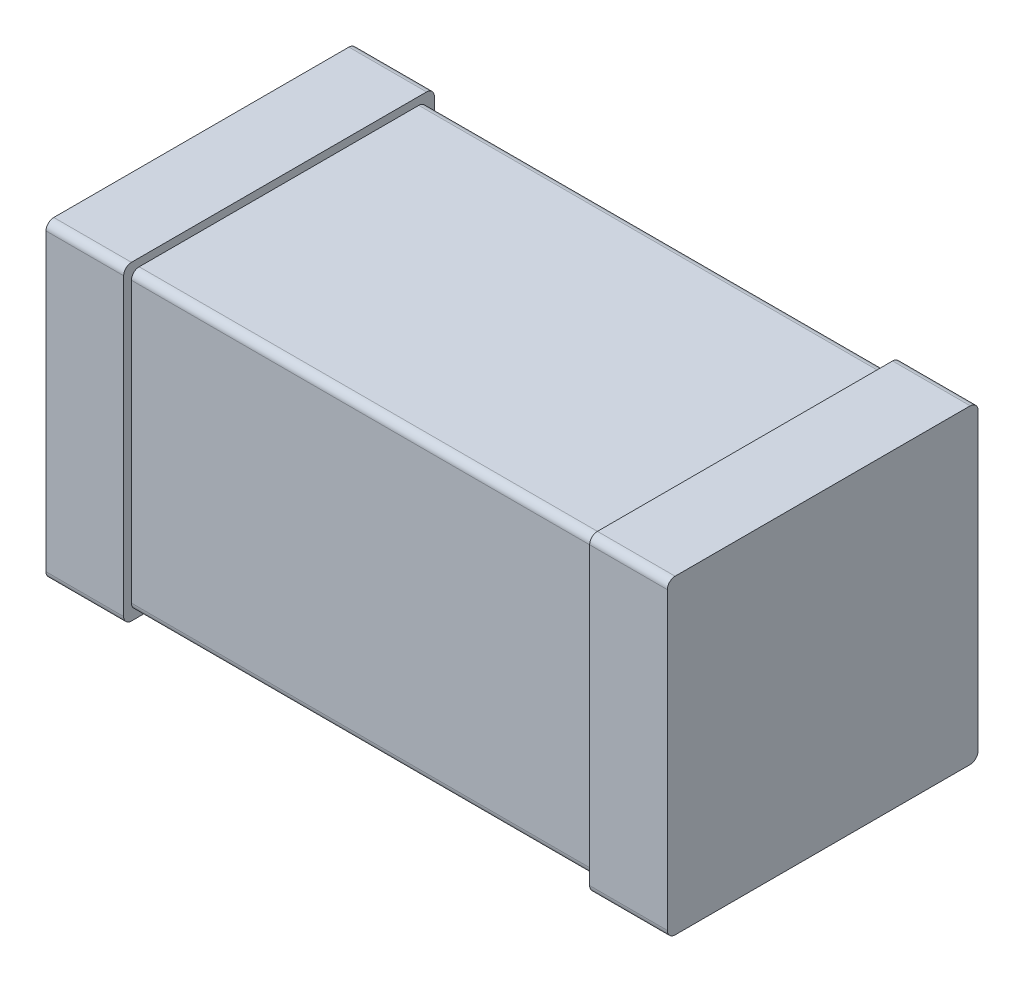
ISO-10303-21;
HEADER;
FILE_DESCRIPTION(('STEP AP214'),'2;1');
FILE_NAME('part.step','',(''),(''),'','','');
FILE_SCHEMA(('AUTOMOTIVE_DESIGN { 1 0 10303 214 1 1 1 1 }'));
ENDSEC;
DATA;
#1=APPLICATION_CONTEXT('core data for automotive mechanical design processes');
#2=APPLICATION_PROTOCOL_DEFINITION('international standard','automotive_design',2000,#1);
#3=PRODUCT_CONTEXT('',#1,'mechanical');
#4=PRODUCT('Part','Part','',(#3));
#5=PRODUCT_RELATED_PRODUCT_CATEGORY('part','',(#4));
#6=PRODUCT_DEFINITION_FORMATION('','',#4);
#7=PRODUCT_DEFINITION_CONTEXT('part definition',#1,'design');
#8=PRODUCT_DEFINITION('design','',#6,#7);
#9=PRODUCT_DEFINITION_SHAPE('','',#8);
#10=(LENGTH_UNIT() NAMED_UNIT(*) SI_UNIT(.MILLI.,.METRE.));
#11=(NAMED_UNIT(*) PLANE_ANGLE_UNIT() SI_UNIT($,.RADIAN.));
#12=(NAMED_UNIT(*) SI_UNIT($,.STERADIAN.) SOLID_ANGLE_UNIT());
#13=UNCERTAINTY_MEASURE_WITH_UNIT(LENGTH_MEASURE(1.E-05),#10,'distance_accuracy_value','');
#14=(GEOMETRIC_REPRESENTATION_CONTEXT(3) GLOBAL_UNCERTAINTY_ASSIGNED_CONTEXT((#13)) GLOBAL_UNIT_ASSIGNED_CONTEXT((#10,
#11,#12)) REPRESENTATION_CONTEXT('',''));
#15=CARTESIAN_POINT('',(0.,0.,0.));
#16=DIRECTION('',(0.,0.,1.));
#17=DIRECTION('',(1.,0.,0.));
#18=AXIS2_PLACEMENT_3D('',#15,#16,#17);
#19=CARTESIAN_POINT('',(-1.6,-0.8,0.));
#20=DIRECTION('',(1.,0.,0.));
#21=DIRECTION('',(0.,1.,0.));
#22=AXIS2_PLACEMENT_3D('',#19,#20,#21);
#23=PLANE('',#22);
#24=CARTESIAN_POINT('',(-1.6,-0.76,1.56));
#25=DIRECTION('',(-1.,0.,0.));
#26=DIRECTION('',(0.,0.,1.));
#27=AXIS2_PLACEMENT_3D('',#24,#25,#26);
#28=CIRCLE('',#27,0.04);
#29=CARTESIAN_POINT('',(-1.6,-0.8,1.56));
#30=VERTEX_POINT('',#29);
#31=CARTESIAN_POINT('',(-1.6,-0.76,1.6));
#32=VERTEX_POINT('',#31);
#33=EDGE_CURVE('E11',#30,#32,#28,.T.);
#34=ORIENTED_EDGE('',*,*,#33,.T.);
#35=DIRECTION('',(0.,1.,0.));
#36=VECTOR('',#35,1.);
#37=CARTESIAN_POINT('',(-1.6,-0.8,1.6));
#38=LINE('',#37,#36);
#39=CARTESIAN_POINT('',(-1.6,0.76,1.6));
#40=VERTEX_POINT('',#39);
#41=EDGE_CURVE('E27',#32,#40,#38,.T.);
#42=ORIENTED_EDGE('',*,*,#41,.T.);
#43=CARTESIAN_POINT('',(-1.6,0.76,1.56));
#44=DIRECTION('',(1.,0.,0.));
#45=DIRECTION('',(0.,0.,1.));
#46=AXIS2_PLACEMENT_3D('',#43,#44,#45);
#47=CIRCLE('',#46,0.04);
#48=CARTESIAN_POINT('',(-1.6,0.8,1.56));
#49=VERTEX_POINT('',#48);
#50=EDGE_CURVE('E280',#49,#40,#47,.T.);
#51=ORIENTED_EDGE('',*,*,#50,.F.);
#52=DIRECTION('',(0.,0.,1.));
#53=VECTOR('',#52,1.);
#54=CARTESIAN_POINT('',(-1.6,0.8,0.));
#55=LINE('',#54,#53);
#56=CARTESIAN_POINT('',(-1.6,0.8,0.04));
#57=VERTEX_POINT('',#56);
#58=EDGE_CURVE('E359',#57,#49,#55,.T.);
#59=ORIENTED_EDGE('',*,*,#58,.F.);
#60=CARTESIAN_POINT('',(-1.6,0.76,0.04));
#61=DIRECTION('',(-1.,0.,0.));
#62=DIRECTION('',(0.,0.,1.));
#63=AXIS2_PLACEMENT_3D('',#60,#61,#62);
#64=CIRCLE('',#63,0.04);
#65=CARTESIAN_POINT('',(-1.6,0.76,0.));
#66=VERTEX_POINT('',#65);
#67=EDGE_CURVE('E328',#57,#66,#64,.T.);
#68=ORIENTED_EDGE('',*,*,#67,.T.);
#69=DIRECTION('',(0.,1.,0.));
#70=VECTOR('',#69,1.);
#71=CARTESIAN_POINT('',(-1.6,-0.8,0.));
#72=LINE('',#71,#70);
#73=CARTESIAN_POINT('',(-1.6,-0.76,0.));
#74=VERTEX_POINT('',#73);
#75=EDGE_CURVE('E186',#74,#66,#72,.T.);
#76=ORIENTED_EDGE('',*,*,#75,.F.);
#77=CARTESIAN_POINT('',(-1.6,-0.76,0.04));
#78=DIRECTION('',(1.,0.,0.));
#79=DIRECTION('',(0.,0.,1.));
#80=AXIS2_PLACEMENT_3D('',#77,#78,#79);
#81=CIRCLE('',#80,0.04);
#82=CARTESIAN_POINT('',(-1.6,-0.8,0.04));
#83=VERTEX_POINT('',#82);
#84=EDGE_CURVE('E302',#83,#74,#81,.T.);
#85=ORIENTED_EDGE('',*,*,#84,.F.);
#86=DIRECTION('',(0.,0.,1.));
#87=VECTOR('',#86,1.);
#88=CARTESIAN_POINT('',(-1.6,-0.8,0.));
#89=LINE('',#88,#87);
#90=EDGE_CURVE('E325',#83,#30,#89,.T.);
#91=ORIENTED_EDGE('',*,*,#90,.T.);
#92=EDGE_LOOP('',(#34,#42,#51,#59,#68,#76,#85,#91));
#93=FACE_BOUND('',#92,.T.);
#94=ADVANCED_FACE('F16',(#93),#23,.F.);
#95=CARTESIAN_POINT('',(-1.6,-0.8,0.));
#96=DIRECTION('',(0.,1.,0.));
#97=DIRECTION('',(1.,0.,0.));
#98=AXIS2_PLACEMENT_3D('',#95,#96,#97);
#99=PLANE('',#98);
#100=DIRECTION('',(1.,0.,0.));
#101=VECTOR('',#100,1.);
#102=CARTESIAN_POINT('',(-1.6,-0.8,1.56));
#103=LINE('',#102,#101);
#104=CARTESIAN_POINT('',(-1.2,-0.8,1.56));
#105=VERTEX_POINT('',#104);
#106=EDGE_CURVE('E358',#30,#105,#103,.T.);
#107=ORIENTED_EDGE('',*,*,#106,.F.);
#108=ORIENTED_EDGE('',*,*,#90,.F.);
#109=DIRECTION('',(1.,0.,0.));
#110=VECTOR('',#109,1.);
#111=CARTESIAN_POINT('',(-1.6,-0.8,0.04));
#112=LINE('',#111,#110);
#113=CARTESIAN_POINT('',(-1.2,-0.8,0.04));
#114=VERTEX_POINT('',#113);
#115=EDGE_CURVE('E329',#83,#114,#112,.T.);
#116=ORIENTED_EDGE('',*,*,#115,.T.);
#117=DIRECTION('',(0.,0.,1.));
#118=VECTOR('',#117,1.);
#119=CARTESIAN_POINT('',(-1.2,-0.8,0.));
#120=LINE('',#119,#118);
#121=EDGE_CURVE('E305',#114,#105,#120,.T.);
#122=ORIENTED_EDGE('',*,*,#121,.T.);
#123=EDGE_LOOP('',(#107,#108,#116,#122));
#124=FACE_BOUND('',#123,.T.);
#125=ADVANCED_FACE('F553',(#124),#99,.F.);
#126=CARTESIAN_POINT('',(-1.6,-0.76,0.04));
#127=DIRECTION('',(1.,0.,0.));
#128=DIRECTION('',(0.,-1.,0.));
#129=AXIS2_PLACEMENT_3D('',#126,#127,#128);
#130=CYLINDRICAL_SURFACE('',#129,0.04);
#131=ORIENTED_EDGE('',*,*,#84,.T.);
#132=DIRECTION('',(1.,0.,0.));
#133=VECTOR('',#132,1.);
#134=CARTESIAN_POINT('',(-1.6,-0.76,0.));
#135=LINE('',#134,#133);
#136=CARTESIAN_POINT('',(-1.2,-0.76,0.));
#137=VERTEX_POINT('',#136);
#138=EDGE_CURVE('E306',#74,#137,#135,.T.);
#139=ORIENTED_EDGE('',*,*,#138,.T.);
#140=CARTESIAN_POINT('',(-1.2,-0.76,0.04));
#141=DIRECTION('',(1.,0.,0.));
#142=DIRECTION('',(0.,0.,1.));
#143=AXIS2_PLACEMENT_3D('',#140,#141,#142);
#144=CIRCLE('',#143,0.04);
#145=EDGE_CURVE('E394',#114,#137,#144,.T.);
#146=ORIENTED_EDGE('',*,*,#145,.F.);
#147=ORIENTED_EDGE('',*,*,#115,.F.);
#148=EDGE_LOOP('',(#131,#139,#146,#147));
#149=FACE_BOUND('',#148,.T.);
#150=ADVANCED_FACE('F559',(#149),#130,.T.);
#151=CARTESIAN_POINT('',(-1.6,-0.76,1.56));
#152=DIRECTION('',(1.,0.,0.));
#153=DIRECTION('',(0.,-1.,0.));
#154=AXIS2_PLACEMENT_3D('',#151,#152,#153);
#155=CYLINDRICAL_SURFACE('',#154,0.04);
#156=ORIENTED_EDGE('',*,*,#106,.T.);
#157=CARTESIAN_POINT('',(-1.2,-0.76,1.56));
#158=DIRECTION('',(-1.,0.,0.));
#159=DIRECTION('',(0.,0.,1.));
#160=AXIS2_PLACEMENT_3D('',#157,#158,#159);
#161=CIRCLE('',#160,0.04);
#162=CARTESIAN_POINT('',(-1.2,-0.76,1.6));
#163=VERTEX_POINT('',#162);
#164=EDGE_CURVE('E373',#105,#163,#161,.T.);
#165=ORIENTED_EDGE('',*,*,#164,.T.);
#166=DIRECTION('',(1.,0.,0.));
#167=VECTOR('',#166,1.);
#168=CARTESIAN_POINT('',(-1.6,-0.76,1.6));
#169=LINE('',#168,#167);
#170=EDGE_CURVE('E324',#32,#163,#169,.T.);
#171=ORIENTED_EDGE('',*,*,#170,.F.);
#172=ORIENTED_EDGE('',*,*,#33,.F.);
#173=EDGE_LOOP('',(#156,#165,#171,#172));
#174=FACE_BOUND('',#173,.T.);
#175=ADVANCED_FACE('F588',(#174),#155,.T.);
#176=CARTESIAN_POINT('',(-1.6,-0.8,0.));
#177=DIRECTION('',(0.,0.,1.));
#178=DIRECTION('',(1.,0.,0.));
#179=AXIS2_PLACEMENT_3D('',#176,#177,#178);
#180=PLANE('',#179);
#181=DIRECTION('',(1.,0.,0.));
#182=VECTOR('',#181,1.);
#183=CARTESIAN_POINT('',(-1.6,0.76,0.));
#184=LINE('',#183,#182);
#185=CARTESIAN_POINT('',(-1.2,0.76,0.));
#186=VERTEX_POINT('',#185);
#187=EDGE_CURVE('E323',#66,#186,#184,.T.);
#188=ORIENTED_EDGE('',*,*,#187,.T.);
#189=DIRECTION('',(0.,1.,0.));
#190=VECTOR('',#189,1.);
#191=CARTESIAN_POINT('',(-1.2,-0.8,0.));
#192=LINE('',#191,#190);
#193=EDGE_CURVE('E391',#137,#186,#192,.T.);
#194=ORIENTED_EDGE('',*,*,#193,.F.);
#195=ORIENTED_EDGE('',*,*,#138,.F.);
#196=ORIENTED_EDGE('',*,*,#75,.T.);
#197=EDGE_LOOP('',(#188,#194,#195,#196));
#198=FACE_BOUND('',#197,.T.);
#199=ADVANCED_FACE('F591',(#198),#180,.F.);
#200=CARTESIAN_POINT('',(-1.6,-0.8,1.6));
#201=DIRECTION('',(0.,0.,1.));
#202=DIRECTION('',(1.,0.,0.));
#203=AXIS2_PLACEMENT_3D('',#200,#201,#202);
#204=PLANE('',#203);
#205=ORIENTED_EDGE('',*,*,#41,.F.);
#206=ORIENTED_EDGE('',*,*,#170,.T.);
#207=DIRECTION('',(0.,1.,0.));
#208=VECTOR('',#207,1.);
#209=CARTESIAN_POINT('',(-1.2,-0.8,1.6));
#210=LINE('',#209,#208);
#211=CARTESIAN_POINT('',(-1.2,0.76,1.6));
#212=VERTEX_POINT('',#211);
#213=EDGE_CURVE('E341',#163,#212,#210,.T.);
#214=ORIENTED_EDGE('',*,*,#213,.T.);
#215=DIRECTION('',(1.,0.,0.));
#216=VECTOR('',#215,1.);
#217=CARTESIAN_POINT('',(-1.6,0.76,1.6));
#218=LINE('',#217,#216);
#219=EDGE_CURVE('E344',#40,#212,#218,.T.);
#220=ORIENTED_EDGE('',*,*,#219,.F.);
#221=EDGE_LOOP('',(#205,#206,#214,#220));
#222=FACE_BOUND('',#221,.T.);
#223=ADVANCED_FACE('F754',(#222),#204,.T.);
#224=CARTESIAN_POINT('',(-1.6,0.76,0.04));
#225=DIRECTION('',(1.,0.,0.));
#226=DIRECTION('',(0.,1.,0.));
#227=AXIS2_PLACEMENT_3D('',#224,#225,#226);
#228=CYLINDRICAL_SURFACE('',#227,0.04);
#229=DIRECTION('',(1.,0.,0.));
#230=VECTOR('',#229,1.);
#231=CARTESIAN_POINT('',(-1.6,0.8,0.04));
#232=LINE('',#231,#230);
#233=CARTESIAN_POINT('',(-1.2,0.8,0.04));
#234=VERTEX_POINT('',#233);
#235=EDGE_CURVE('E279',#57,#234,#232,.T.);
#236=ORIENTED_EDGE('',*,*,#235,.T.);
#237=CARTESIAN_POINT('',(-1.2,0.76,0.04));
#238=DIRECTION('',(-1.,0.,0.));
#239=DIRECTION('',(0.,0.,1.));
#240=AXIS2_PLACEMENT_3D('',#237,#238,#239);
#241=CIRCLE('',#240,0.04);
#242=EDGE_CURVE('E275',#234,#186,#241,.T.);
#243=ORIENTED_EDGE('',*,*,#242,.T.);
#244=ORIENTED_EDGE('',*,*,#187,.F.);
#245=ORIENTED_EDGE('',*,*,#67,.F.);
#246=EDGE_LOOP('',(#236,#243,#244,#245));
#247=FACE_BOUND('',#246,.T.);
#248=ADVANCED_FACE('F18',(#247),#228,.T.);
#249=CARTESIAN_POINT('',(-1.6,0.76,1.56));
#250=DIRECTION('',(1.,0.,0.));
#251=DIRECTION('',(0.,1.,0.));
#252=AXIS2_PLACEMENT_3D('',#249,#250,#251);
#253=CYLINDRICAL_SURFACE('',#252,0.04);
#254=ORIENTED_EDGE('',*,*,#50,.T.);
#255=ORIENTED_EDGE('',*,*,#219,.T.);
#256=CARTESIAN_POINT('',(-1.2,0.76,1.56));
#257=DIRECTION('',(1.,0.,0.));
#258=DIRECTION('',(0.,0.,1.));
#259=AXIS2_PLACEMENT_3D('',#256,#257,#258);
#260=CIRCLE('',#259,0.04);
#261=CARTESIAN_POINT('',(-1.2,0.8,1.56));
#262=VERTEX_POINT('',#261);
#263=EDGE_CURVE('E427',#262,#212,#260,.T.);
#264=ORIENTED_EDGE('',*,*,#263,.F.);
#265=DIRECTION('',(1.,0.,0.));
#266=VECTOR('',#265,1.);
#267=CARTESIAN_POINT('',(-1.6,0.8,1.56));
#268=LINE('',#267,#266);
#269=EDGE_CURVE('E362',#49,#262,#268,.T.);
#270=ORIENTED_EDGE('',*,*,#269,.F.);
#271=EDGE_LOOP('',(#254,#255,#264,#270));
#272=FACE_BOUND('',#271,.T.);
#273=ADVANCED_FACE('F547',(#272),#253,.T.);
#274=CARTESIAN_POINT('',(-1.6,0.8,0.));
#275=DIRECTION('',(0.,1.,0.));
#276=DIRECTION('',(1.,0.,0.));
#277=AXIS2_PLACEMENT_3D('',#274,#275,#276);
#278=PLANE('',#277);
#279=DIRECTION('',(0.,0.,1.));
#280=VECTOR('',#279,1.);
#281=CARTESIAN_POINT('',(-1.2,0.8,0.));
#282=LINE('',#281,#280);
#283=EDGE_CURVE('E395',#234,#262,#282,.T.);
#284=ORIENTED_EDGE('',*,*,#283,.F.);
#285=ORIENTED_EDGE('',*,*,#235,.F.);
#286=ORIENTED_EDGE('',*,*,#58,.T.);
#287=ORIENTED_EDGE('',*,*,#269,.T.);
#288=EDGE_LOOP('',(#284,#285,#286,#287));
#289=FACE_BOUND('',#288,.T.);
#290=ADVANCED_FACE('F536',(#289),#278,.T.);
#291=CARTESIAN_POINT('',(-1.2,-0.8,0.));
#292=DIRECTION('',(1.,0.,0.));
#293=DIRECTION('',(0.,1.,0.));
#294=AXIS2_PLACEMENT_3D('',#291,#292,#293);
#295=PLANE('',#294);
#296=ORIENTED_EDGE('',*,*,#121,.F.);
#297=ORIENTED_EDGE('',*,*,#145,.T.);
#298=ORIENTED_EDGE('',*,*,#193,.T.);
#299=ORIENTED_EDGE('',*,*,#242,.F.);
#300=ORIENTED_EDGE('',*,*,#283,.T.);
#301=ORIENTED_EDGE('',*,*,#263,.T.);
#302=ORIENTED_EDGE('',*,*,#213,.F.);
#303=ORIENTED_EDGE('',*,*,#164,.F.);
#304=EDGE_LOOP('',(#296,#297,#298,#299,#300,#301,#302,#303));
#305=FACE_BOUND('',#304,.T.);
#306=CARTESIAN_POINT('',(-1.2,-0.72,0.08));
#307=DIRECTION('',(1.,0.,0.));
#308=DIRECTION('',(0.,0.,1.));
#309=AXIS2_PLACEMENT_3D('',#306,#307,#308);
#310=CIRCLE('',#309,0.04);
#311=CARTESIAN_POINT('',(-1.2,-0.76,0.08));
#312=VERTEX_POINT('',#311);
#313=CARTESIAN_POINT('',(-1.2,-0.72,0.04));
#314=VERTEX_POINT('',#313);
#315=EDGE_CURVE('E408',#312,#314,#310,.T.);
#316=ORIENTED_EDGE('',*,*,#315,.F.);
#317=DIRECTION('',(0.,0.,1.));
#318=VECTOR('',#317,1.);
#319=CARTESIAN_POINT('',(-1.2,-0.76,0.04));
#320=LINE('',#319,#318);
#321=CARTESIAN_POINT('',(-1.2,-0.76,1.52));
#322=VERTEX_POINT('',#321);
#323=EDGE_CURVE('E431',#312,#322,#320,.T.);
#324=ORIENTED_EDGE('',*,*,#323,.T.);
#325=CARTESIAN_POINT('',(-1.2,-0.72,1.52));
#326=DIRECTION('',(-1.,0.,0.));
#327=DIRECTION('',(0.,0.,1.));
#328=AXIS2_PLACEMENT_3D('',#325,#326,#327);
#329=CIRCLE('',#328,0.04);
#330=CARTESIAN_POINT('',(-1.2,-0.72,1.56));
#331=VERTEX_POINT('',#330);
#332=EDGE_CURVE('E311',#322,#331,#329,.T.);
#333=ORIENTED_EDGE('',*,*,#332,.T.);
#334=DIRECTION('',(0.,1.,0.));
#335=VECTOR('',#334,1.);
#336=CARTESIAN_POINT('',(-1.2,-0.76,1.56));
#337=LINE('',#336,#335);
#338=CARTESIAN_POINT('',(-1.2,0.72,1.56));
#339=VERTEX_POINT('',#338);
#340=EDGE_CURVE('E307',#331,#339,#337,.T.);
#341=ORIENTED_EDGE('',*,*,#340,.T.);
#342=CARTESIAN_POINT('',(-1.2,0.72,1.52));
#343=DIRECTION('',(1.,0.,0.));
#344=DIRECTION('',(0.,0.,1.));
#345=AXIS2_PLACEMENT_3D('',#342,#343,#344);
#346=CIRCLE('',#345,0.04);
#347=CARTESIAN_POINT('',(-1.2,0.76,1.52));
#348=VERTEX_POINT('',#347);
#349=EDGE_CURVE('E353',#348,#339,#346,.T.);
#350=ORIENTED_EDGE('',*,*,#349,.F.);
#351=DIRECTION('',(0.,0.,1.));
#352=VECTOR('',#351,1.);
#353=CARTESIAN_POINT('',(-1.2,0.76,0.04));
#354=LINE('',#353,#352);
#355=CARTESIAN_POINT('',(-1.2,0.76,0.08));
#356=VERTEX_POINT('',#355);
#357=EDGE_CURVE('E387',#356,#348,#354,.T.);
#358=ORIENTED_EDGE('',*,*,#357,.F.);
#359=CARTESIAN_POINT('',(-1.2,0.72,0.08));
#360=DIRECTION('',(-1.,0.,0.));
#361=DIRECTION('',(0.,0.,1.));
#362=AXIS2_PLACEMENT_3D('',#359,#360,#361);
#363=CIRCLE('',#362,0.04);
#364=CARTESIAN_POINT('',(-1.2,0.72,0.04));
#365=VERTEX_POINT('',#364);
#366=EDGE_CURVE('E312',#356,#365,#363,.T.);
#367=ORIENTED_EDGE('',*,*,#366,.T.);
#368=DIRECTION('',(0.,1.,0.));
#369=VECTOR('',#368,1.);
#370=CARTESIAN_POINT('',(-1.2,-0.76,0.04));
#371=LINE('',#370,#369);
#372=EDGE_CURVE('E334',#314,#365,#371,.T.);
#373=ORIENTED_EDGE('',*,*,#372,.F.);
#374=EDGE_LOOP('',(#316,#324,#333,#341,#350,#358,#367,#373));
#375=FACE_BOUND('',#374,.T.);
#376=ADVANCED_FACE('F531',(#305,#375),#295,.T.);
#377=CARTESIAN_POINT('',(-1.2,-0.72,0.08));
#378=DIRECTION('',(1.,0.,0.));
#379=DIRECTION('',(0.,-1.,0.));
#380=AXIS2_PLACEMENT_3D('',#377,#378,#379);
#381=CYLINDRICAL_SURFACE('',#380,0.04);
#382=ORIENTED_EDGE('',*,*,#315,.T.);
#383=DIRECTION('',(1.,0.,0.));
#384=VECTOR('',#383,1.);
#385=CARTESIAN_POINT('',(-1.2,-0.72,0.04));
#386=LINE('',#385,#384);
#387=CARTESIAN_POINT('',(1.2,-0.72,0.04));
#388=VERTEX_POINT('',#387);
#389=EDGE_CURVE('E404',#314,#388,#386,.T.);
#390=ORIENTED_EDGE('',*,*,#389,.T.);
#391=CARTESIAN_POINT('',(1.2,-0.72,0.08));
#392=DIRECTION('',(1.,0.,0.));
#393=DIRECTION('',(0.,0.,1.));
#394=AXIS2_PLACEMENT_3D('',#391,#392,#393);
#395=CIRCLE('',#394,0.04);
#396=CARTESIAN_POINT('',(1.2,-0.76,0.08));
#397=VERTEX_POINT('',#396);
#398=EDGE_CURVE('E400',#397,#388,#395,.T.);
#399=ORIENTED_EDGE('',*,*,#398,.F.);
#400=DIRECTION('',(1.,0.,0.));
#401=VECTOR('',#400,1.);
#402=CARTESIAN_POINT('',(-1.2,-0.76,0.08));
#403=LINE('',#402,#401);
#404=EDGE_CURVE('E300',#312,#397,#403,.T.);
#405=ORIENTED_EDGE('',*,*,#404,.F.);
#406=EDGE_LOOP('',(#382,#390,#399,#405));
#407=FACE_BOUND('',#406,.T.);
#408=ADVANCED_FACE('F521',(#407),#381,.T.);
#409=CARTESIAN_POINT('',(-1.2,-0.76,0.04));
#410=DIRECTION('',(0.,0.,1.));
#411=DIRECTION('',(1.,0.,0.));
#412=AXIS2_PLACEMENT_3D('',#409,#410,#411);
#413=PLANE('',#412);
#414=DIRECTION('',(1.,0.,0.));
#415=VECTOR('',#414,1.);
#416=CARTESIAN_POINT('',(-1.2,0.72,0.04));
#417=LINE('',#416,#415);
#418=CARTESIAN_POINT('',(1.2,0.72,0.04));
#419=VERTEX_POINT('',#418);
#420=EDGE_CURVE('E409',#365,#419,#417,.T.);
#421=ORIENTED_EDGE('',*,*,#420,.T.);
#422=DIRECTION('',(0.,1.,0.));
#423=VECTOR('',#422,1.);
#424=CARTESIAN_POINT('',(1.2,-0.76,0.04));
#425=LINE('',#424,#423);
#426=EDGE_CURVE('E363',#388,#419,#425,.T.);
#427=ORIENTED_EDGE('',*,*,#426,.F.);
#428=ORIENTED_EDGE('',*,*,#389,.F.);
#429=ORIENTED_EDGE('',*,*,#372,.T.);
#430=EDGE_LOOP('',(#421,#427,#428,#429));
#431=FACE_BOUND('',#430,.T.);
#432=ADVANCED_FACE('F526',(#431),#413,.F.);
#433=CARTESIAN_POINT('',(-1.2,0.72,0.08));
#434=DIRECTION('',(1.,0.,0.));
#435=DIRECTION('',(0.,1.,0.));
#436=AXIS2_PLACEMENT_3D('',#433,#434,#435);
#437=CYLINDRICAL_SURFACE('',#436,0.04);
#438=DIRECTION('',(1.,0.,0.));
#439=VECTOR('',#438,1.);
#440=CARTESIAN_POINT('',(-1.2,0.76,0.08));
#441=LINE('',#440,#439);
#442=CARTESIAN_POINT('',(1.2,0.76,0.08));
#443=VERTEX_POINT('',#442);
#444=EDGE_CURVE('E330',#356,#443,#441,.T.);
#445=ORIENTED_EDGE('',*,*,#444,.T.);
#446=CARTESIAN_POINT('',(1.2,0.72,0.08));
#447=DIRECTION('',(-1.,0.,0.));
#448=DIRECTION('',(0.,0.,1.));
#449=AXIS2_PLACEMENT_3D('',#446,#447,#448);
#450=CIRCLE('',#449,0.04);
#451=EDGE_CURVE('E335',#443,#419,#450,.T.);
#452=ORIENTED_EDGE('',*,*,#451,.T.);
#453=ORIENTED_EDGE('',*,*,#420,.F.);
#454=ORIENTED_EDGE('',*,*,#366,.F.);
#455=EDGE_LOOP('',(#445,#452,#453,#454));
#456=FACE_BOUND('',#455,.T.);
#457=ADVANCED_FACE('F529',(#456),#437,.T.);
#458=CARTESIAN_POINT('',(-1.2,0.76,0.04));
#459=DIRECTION('',(0.,1.,0.));
#460=DIRECTION('',(1.,0.,0.));
#461=AXIS2_PLACEMENT_3D('',#458,#459,#460);
#462=PLANE('',#461);
#463=DIRECTION('',(0.,0.,1.));
#464=VECTOR('',#463,1.);
#465=CARTESIAN_POINT('',(1.2,0.76,0.04));
#466=LINE('',#465,#464);
#467=CARTESIAN_POINT('',(1.2,0.76,1.52));
#468=VERTEX_POINT('',#467);
#469=EDGE_CURVE('E367',#443,#468,#466,.T.);
#470=ORIENTED_EDGE('',*,*,#469,.F.);
#471=ORIENTED_EDGE('',*,*,#444,.F.);
#472=ORIENTED_EDGE('',*,*,#357,.T.);
#473=DIRECTION('',(1.,0.,0.));
#474=VECTOR('',#473,1.);
#475=CARTESIAN_POINT('',(-1.2,0.76,1.52));
#476=LINE('',#475,#474);
#477=EDGE_CURVE('E383',#348,#468,#476,.T.);
#478=ORIENTED_EDGE('',*,*,#477,.T.);
#479=EDGE_LOOP('',(#470,#471,#472,#478));
#480=FACE_BOUND('',#479,.T.);
#481=ADVANCED_FACE('F504',(#480),#462,.T.);
#482=CARTESIAN_POINT('',(-1.2,0.72,1.52));
#483=DIRECTION('',(1.,0.,0.));
#484=DIRECTION('',(0.,1.,0.));
#485=AXIS2_PLACEMENT_3D('',#482,#483,#484);
#486=CYLINDRICAL_SURFACE('',#485,0.04);
#487=ORIENTED_EDGE('',*,*,#349,.T.);
#488=DIRECTION('',(1.,0.,0.));
#489=VECTOR('',#488,1.);
#490=CARTESIAN_POINT('',(-1.2,0.72,1.56));
#491=LINE('',#490,#489);
#492=CARTESIAN_POINT('',(1.2,0.72,1.56));
#493=VERTEX_POINT('',#492);
#494=EDGE_CURVE('E349',#339,#493,#491,.T.);
#495=ORIENTED_EDGE('',*,*,#494,.T.);
#496=CARTESIAN_POINT('',(1.2,0.72,1.52));
#497=DIRECTION('',(1.,0.,0.));
#498=DIRECTION('',(0.,0.,1.));
#499=AXIS2_PLACEMENT_3D('',#496,#497,#498);
#500=CIRCLE('',#499,0.04);
#501=EDGE_CURVE('E403',#468,#493,#500,.T.);
#502=ORIENTED_EDGE('',*,*,#501,.F.);
#503=ORIENTED_EDGE('',*,*,#477,.F.);
#504=EDGE_LOOP('',(#487,#495,#502,#503));
#505=FACE_BOUND('',#504,.T.);
#506=ADVANCED_FACE('F506',(#505),#486,.T.);
#507=CARTESIAN_POINT('',(-1.2,-0.76,1.56));
#508=DIRECTION('',(0.,0.,1.));
#509=DIRECTION('',(1.,0.,0.));
#510=AXIS2_PLACEMENT_3D('',#507,#508,#509);
#511=PLANE('',#510);
#512=ORIENTED_EDGE('',*,*,#340,.F.);
#513=DIRECTION('',(1.,0.,0.));
#514=VECTOR('',#513,1.);
#515=CARTESIAN_POINT('',(-1.2,-0.72,1.56));
#516=LINE('',#515,#514);
#517=CARTESIAN_POINT('',(1.2,-0.72,1.56));
#518=VERTEX_POINT('',#517);
#519=EDGE_CURVE('E354',#331,#518,#516,.T.);
#520=ORIENTED_EDGE('',*,*,#519,.T.);
#521=DIRECTION('',(0.,1.,0.));
#522=VECTOR('',#521,1.);
#523=CARTESIAN_POINT('',(1.2,-0.76,1.56));
#524=LINE('',#523,#522);
#525=EDGE_CURVE('E288',#518,#493,#524,.T.);
#526=ORIENTED_EDGE('',*,*,#525,.T.);
#527=ORIENTED_EDGE('',*,*,#494,.F.);
#528=EDGE_LOOP('',(#512,#520,#526,#527));
#529=FACE_BOUND('',#528,.T.);
#530=ADVANCED_FACE('F510',(#529),#511,.T.);
#531=CARTESIAN_POINT('',(-1.2,-0.72,1.52));
#532=DIRECTION('',(1.,0.,0.));
#533=DIRECTION('',(0.,-1.,0.));
#534=AXIS2_PLACEMENT_3D('',#531,#532,#533);
#535=CYLINDRICAL_SURFACE('',#534,0.04);
#536=DIRECTION('',(1.,0.,0.));
#537=VECTOR('',#536,1.);
#538=CARTESIAN_POINT('',(-1.2,-0.76,1.52));
#539=LINE('',#538,#537);
#540=CARTESIAN_POINT('',(1.2,-0.76,1.52));
#541=VERTEX_POINT('',#540);
#542=EDGE_CURVE('E284',#322,#541,#539,.T.);
#543=ORIENTED_EDGE('',*,*,#542,.T.);
#544=CARTESIAN_POINT('',(1.2,-0.72,1.52));
#545=DIRECTION('',(-1.,0.,0.));
#546=DIRECTION('',(0.,0.,1.));
#547=AXIS2_PLACEMENT_3D('',#544,#545,#546);
#548=CIRCLE('',#547,0.04);
#549=EDGE_CURVE('E289',#541,#518,#548,.T.);
#550=ORIENTED_EDGE('',*,*,#549,.T.);
#551=ORIENTED_EDGE('',*,*,#519,.F.);
#552=ORIENTED_EDGE('',*,*,#332,.F.);
#553=EDGE_LOOP('',(#543,#550,#551,#552));
#554=FACE_BOUND('',#553,.T.);
#555=ADVANCED_FACE('F515',(#554),#535,.T.);
#556=CARTESIAN_POINT('',(-1.2,-0.76,0.04));
#557=DIRECTION('',(0.,1.,0.));
#558=DIRECTION('',(1.,0.,0.));
#559=AXIS2_PLACEMENT_3D('',#556,#557,#558);
#560=PLANE('',#559);
#561=ORIENTED_EDGE('',*,*,#542,.F.);
#562=ORIENTED_EDGE('',*,*,#323,.F.);
#563=ORIENTED_EDGE('',*,*,#404,.T.);
#564=DIRECTION('',(0.,0.,1.));
#565=VECTOR('',#564,1.);
#566=CARTESIAN_POINT('',(1.2,-0.76,0.04));
#567=LINE('',#566,#565);
#568=EDGE_CURVE('E296',#397,#541,#567,.T.);
#569=ORIENTED_EDGE('',*,*,#568,.T.);
#570=EDGE_LOOP('',(#561,#562,#563,#569));
#571=FACE_BOUND('',#570,.T.);
#572=ADVANCED_FACE('F518',(#571),#560,.F.);
#573=CARTESIAN_POINT('',(1.2,-0.8,0.));
#574=DIRECTION('',(1.,0.,0.));
#575=DIRECTION('',(0.,1.,0.));
#576=AXIS2_PLACEMENT_3D('',#573,#574,#575);
#577=PLANE('',#576);
#578=CARTESIAN_POINT('',(1.2,-0.76,1.56));
#579=DIRECTION('',(-1.,0.,0.));
#580=DIRECTION('',(0.,0.,1.));
#581=AXIS2_PLACEMENT_3D('',#578,#579,#580);
#582=CIRCLE('',#581,0.04);
#583=CARTESIAN_POINT('',(1.2,-0.8,1.56));
#584=VERTEX_POINT('',#583);
#585=CARTESIAN_POINT('',(1.2,-0.76,1.6));
#586=VERTEX_POINT('',#585);
#587=EDGE_CURVE('E301',#584,#586,#582,.T.);
#588=ORIENTED_EDGE('',*,*,#587,.T.);
#589=DIRECTION('',(0.,1.,0.));
#590=VECTOR('',#589,1.);
#591=CARTESIAN_POINT('',(1.2,-0.8,1.6));
#592=LINE('',#591,#590);
#593=CARTESIAN_POINT('',(1.2,0.76,1.6));
#594=VERTEX_POINT('',#593);
#595=EDGE_CURVE('E241',#586,#594,#592,.T.);
#596=ORIENTED_EDGE('',*,*,#595,.T.);
#597=CARTESIAN_POINT('',(1.2,0.76,1.56));
#598=DIRECTION('',(1.,0.,0.));
#599=DIRECTION('',(0.,0.,1.));
#600=AXIS2_PLACEMENT_3D('',#597,#598,#599);
#601=CIRCLE('',#600,0.04);
#602=CARTESIAN_POINT('',(1.2,0.8,1.56));
#603=VERTEX_POINT('',#602);
#604=EDGE_CURVE('E316',#603,#594,#601,.T.);
#605=ORIENTED_EDGE('',*,*,#604,.F.);
#606=DIRECTION('',(0.,0.,1.));
#607=VECTOR('',#606,1.);
#608=CARTESIAN_POINT('',(1.2,0.8,0.));
#609=LINE('',#608,#607);
#610=CARTESIAN_POINT('',(1.2,0.8,0.04));
#611=VERTEX_POINT('',#610);
#612=EDGE_CURVE('E317',#611,#603,#609,.T.);
#613=ORIENTED_EDGE('',*,*,#612,.F.);
#614=CARTESIAN_POINT('',(1.2,0.76,0.04));
#615=DIRECTION('',(-1.,0.,0.));
#616=DIRECTION('',(0.,0.,1.));
#617=AXIS2_PLACEMENT_3D('',#614,#615,#616);
#618=CIRCLE('',#617,0.04);
#619=CARTESIAN_POINT('',(1.2,0.76,0.));
#620=VERTEX_POINT('',#619);
#621=EDGE_CURVE('E320',#611,#620,#618,.T.);
#622=ORIENTED_EDGE('',*,*,#621,.T.);
#623=DIRECTION('',(0.,1.,0.));
#624=VECTOR('',#623,1.);
#625=CARTESIAN_POINT('',(1.2,-0.8,0.));
#626=LINE('',#625,#624);
#627=CARTESIAN_POINT('',(1.2,-0.76,0.));
#628=VERTEX_POINT('',#627);
#629=EDGE_CURVE('E246',#628,#620,#626,.T.);
#630=ORIENTED_EDGE('',*,*,#629,.F.);
#631=CARTESIAN_POINT('',(1.2,-0.76,0.04));
#632=DIRECTION('',(1.,0.,0.));
#633=DIRECTION('',(0.,0.,1.));
#634=AXIS2_PLACEMENT_3D('',#631,#632,#633);
#635=CIRCLE('',#634,0.04);
#636=CARTESIAN_POINT('',(1.2,-0.8,0.04));
#637=VERTEX_POINT('',#636);
#638=EDGE_CURVE('E290',#637,#628,#635,.T.);
#639=ORIENTED_EDGE('',*,*,#638,.F.);
#640=DIRECTION('',(0.,0.,1.));
#641=VECTOR('',#640,1.);
#642=CARTESIAN_POINT('',(1.2,-0.8,0.));
#643=LINE('',#642,#641);
#644=EDGE_CURVE('E366',#637,#584,#643,.T.);
#645=ORIENTED_EDGE('',*,*,#644,.T.);
#646=EDGE_LOOP('',(#588,#596,#605,#613,#622,#630,#639,#645));
#647=FACE_BOUND('',#646,.T.);
#648=ORIENTED_EDGE('',*,*,#426,.T.);
#649=ORIENTED_EDGE('',*,*,#451,.F.);
#650=ORIENTED_EDGE('',*,*,#469,.T.);
#651=ORIENTED_EDGE('',*,*,#501,.T.);
#652=ORIENTED_EDGE('',*,*,#525,.F.);
#653=ORIENTED_EDGE('',*,*,#549,.F.);
#654=ORIENTED_EDGE('',*,*,#568,.F.);
#655=ORIENTED_EDGE('',*,*,#398,.T.);
#656=EDGE_LOOP('',(#648,#649,#650,#651,#652,#653,#654,#655));
#657=FACE_BOUND('',#656,.T.);
#658=ADVANCED_FACE('F499',(#647,#657),#577,.F.);
#659=CARTESIAN_POINT('',(1.2,-0.8,0.));
#660=DIRECTION('',(0.,1.,0.));
#661=DIRECTION('',(1.,0.,0.));
#662=AXIS2_PLACEMENT_3D('',#659,#660,#661);
#663=PLANE('',#662);
#664=DIRECTION('',(1.,0.,0.));
#665=VECTOR('',#664,1.);
#666=CARTESIAN_POINT('',(1.2,-0.8,1.56));
#667=LINE('',#666,#665);
#668=CARTESIAN_POINT('',(1.6,-0.8,1.56));
#669=VERTEX_POINT('',#668);
#670=EDGE_CURVE('E251',#584,#669,#667,.T.);
#671=ORIENTED_EDGE('',*,*,#670,.F.);
#672=ORIENTED_EDGE('',*,*,#644,.F.);
#673=DIRECTION('',(1.,0.,0.));
#674=VECTOR('',#673,1.);
#675=CARTESIAN_POINT('',(1.2,-0.8,0.04));
#676=LINE('',#675,#674);
#677=CARTESIAN_POINT('',(1.6,-0.8,0.04));
#678=VERTEX_POINT('',#677);
#679=EDGE_CURVE('E396',#637,#678,#676,.T.);
#680=ORIENTED_EDGE('',*,*,#679,.T.);
#681=DIRECTION('',(0.,0.,1.));
#682=VECTOR('',#681,1.);
#683=CARTESIAN_POINT('',(1.6,-0.8,0.));
#684=LINE('',#683,#682);
#685=EDGE_CURVE('E294',#678,#669,#684,.T.);
#686=ORIENTED_EDGE('',*,*,#685,.T.);
#687=EDGE_LOOP('',(#671,#672,#680,#686));
#688=FACE_BOUND('',#687,.T.);
#689=ADVANCED_FACE('F586',(#688),#663,.F.);
#690=CARTESIAN_POINT('',(1.2,-0.76,0.04));
#691=DIRECTION('',(1.,0.,0.));
#692=DIRECTION('',(0.,-1.,0.));
#693=AXIS2_PLACEMENT_3D('',#690,#691,#692);
#694=CYLINDRICAL_SURFACE('',#693,0.04);
#695=ORIENTED_EDGE('',*,*,#638,.T.);
#696=DIRECTION('',(1.,0.,0.));
#697=VECTOR('',#696,1.);
#698=CARTESIAN_POINT('',(1.2,-0.76,0.));
#699=LINE('',#698,#697);
#700=CARTESIAN_POINT('',(1.6,-0.76,0.));
#701=VERTEX_POINT('',#700);
#702=EDGE_CURVE('E295',#628,#701,#699,.T.);
#703=ORIENTED_EDGE('',*,*,#702,.T.);
#704=CARTESIAN_POINT('',(1.6,-0.76,0.04));
#705=DIRECTION('',(1.,0.,0.));
#706=DIRECTION('',(0.,0.,1.));
#707=AXIS2_PLACEMENT_3D('',#704,#705,#706);
#708=CIRCLE('',#707,0.04);
#709=EDGE_CURVE('E416',#678,#701,#708,.T.);
#710=ORIENTED_EDGE('',*,*,#709,.F.);
#711=ORIENTED_EDGE('',*,*,#679,.F.);
#712=EDGE_LOOP('',(#695,#703,#710,#711));
#713=FACE_BOUND('',#712,.T.);
#714=ADVANCED_FACE('F567',(#713),#694,.T.);
#715=CARTESIAN_POINT('',(1.2,-0.76,1.56));
#716=DIRECTION('',(1.,0.,0.));
#717=DIRECTION('',(0.,-1.,0.));
#718=AXIS2_PLACEMENT_3D('',#715,#716,#717);
#719=CYLINDRICAL_SURFACE('',#718,0.04);
#720=ORIENTED_EDGE('',*,*,#670,.T.);
#721=CARTESIAN_POINT('',(1.6,-0.76,1.56));
#722=DIRECTION('',(-1.,0.,0.));
#723=DIRECTION('',(0.,0.,1.));
#724=AXIS2_PLACEMENT_3D('',#721,#722,#723);
#725=CIRCLE('',#724,0.04);
#726=CARTESIAN_POINT('',(1.6,-0.76,1.6));
#727=VERTEX_POINT('',#726);
#728=EDGE_CURVE('E248',#669,#727,#725,.T.);
#729=ORIENTED_EDGE('',*,*,#728,.T.);
#730=DIRECTION('',(1.,0.,0.));
#731=VECTOR('',#730,1.);
#732=CARTESIAN_POINT('',(1.2,-0.76,1.6));
#733=LINE('',#732,#731);
#734=EDGE_CURVE('E20',#586,#727,#733,.T.);
#735=ORIENTED_EDGE('',*,*,#734,.F.);
#736=ORIENTED_EDGE('',*,*,#587,.F.);
#737=EDGE_LOOP('',(#720,#729,#735,#736));
#738=FACE_BOUND('',#737,.T.);
#739=ADVANCED_FACE('F249',(#738),#719,.T.);
#740=CARTESIAN_POINT('',(1.2,-0.8,0.));
#741=DIRECTION('',(0.,0.,1.));
#742=DIRECTION('',(1.,0.,0.));
#743=AXIS2_PLACEMENT_3D('',#740,#741,#742);
#744=PLANE('',#743);
#745=DIRECTION('',(1.,0.,0.));
#746=VECTOR('',#745,1.);
#747=CARTESIAN_POINT('',(1.2,0.76,0.));
#748=LINE('',#747,#746);
#749=CARTESIAN_POINT('',(1.6,0.76,0.));
#750=VERTEX_POINT('',#749);
#751=EDGE_CURVE('E256',#620,#750,#748,.T.);
#752=ORIENTED_EDGE('',*,*,#751,.T.);
#753=DIRECTION('',(0.,1.,0.));
#754=VECTOR('',#753,1.);
#755=CARTESIAN_POINT('',(1.6,-0.8,0.));
#756=LINE('',#755,#754);
#757=EDGE_CURVE('E274',#701,#750,#756,.T.);
#758=ORIENTED_EDGE('',*,*,#757,.F.);
#759=ORIENTED_EDGE('',*,*,#702,.F.);
#760=ORIENTED_EDGE('',*,*,#629,.T.);
#761=EDGE_LOOP('',(#752,#758,#759,#760));
#762=FACE_BOUND('',#761,.T.);
#763=ADVANCED_FACE('F566',(#762),#744,.F.);
#764=CARTESIAN_POINT('',(1.2,-0.8,1.6));
#765=DIRECTION('',(0.,0.,1.));
#766=DIRECTION('',(1.,0.,0.));
#767=AXIS2_PLACEMENT_3D('',#764,#765,#766);
#768=PLANE('',#767);
#769=ORIENTED_EDGE('',*,*,#595,.F.);
#770=ORIENTED_EDGE('',*,*,#734,.T.);
#771=DIRECTION('',(0.,1.,0.));
#772=VECTOR('',#771,1.);
#773=CARTESIAN_POINT('',(1.6,-0.8,1.6));
#774=LINE('',#773,#772);
#775=CARTESIAN_POINT('',(1.6,0.76,1.6));
#776=VERTEX_POINT('',#775);
#777=EDGE_CURVE('E238',#727,#776,#774,.T.);
#778=ORIENTED_EDGE('',*,*,#777,.T.);
#779=DIRECTION('',(1.,0.,0.));
#780=VECTOR('',#779,1.);
#781=CARTESIAN_POINT('',(1.2,0.76,1.6));
#782=LINE('',#781,#780);
#783=EDGE_CURVE('E313',#594,#776,#782,.T.);
#784=ORIENTED_EDGE('',*,*,#783,.F.);
#785=EDGE_LOOP('',(#769,#770,#778,#784));
#786=FACE_BOUND('',#785,.T.);
#787=ADVANCED_FACE('F235',(#786),#768,.T.);
#788=CARTESIAN_POINT('',(1.2,0.76,0.04));
#789=DIRECTION('',(1.,0.,0.));
#790=DIRECTION('',(0.,1.,0.));
#791=AXIS2_PLACEMENT_3D('',#788,#789,#790);
#792=CYLINDRICAL_SURFACE('',#791,0.04);
#793=DIRECTION('',(1.,0.,0.));
#794=VECTOR('',#793,1.);
#795=CARTESIAN_POINT('',(1.2,0.8,0.04));
#796=LINE('',#795,#794);
#797=CARTESIAN_POINT('',(1.6,0.8,0.04));
#798=VERTEX_POINT('',#797);
#799=EDGE_CURVE('E262',#611,#798,#796,.T.);
#800=ORIENTED_EDGE('',*,*,#799,.T.);
#801=CARTESIAN_POINT('',(1.6,0.76,0.04));
#802=DIRECTION('',(-1.,0.,0.));
#803=DIRECTION('',(0.,0.,1.));
#804=AXIS2_PLACEMENT_3D('',#801,#802,#803);
#805=CIRCLE('',#804,0.04);
#806=EDGE_CURVE('E267',#798,#750,#805,.T.);
#807=ORIENTED_EDGE('',*,*,#806,.T.);
#808=ORIENTED_EDGE('',*,*,#751,.F.);
#809=ORIENTED_EDGE('',*,*,#621,.F.);
#810=EDGE_LOOP('',(#800,#807,#808,#809));
#811=FACE_BOUND('',#810,.T.);
#812=ADVANCED_FACE('F575',(#811),#792,.T.);
#813=CARTESIAN_POINT('',(1.2,0.76,1.56));
#814=DIRECTION('',(1.,0.,0.));
#815=DIRECTION('',(0.,1.,0.));
#816=AXIS2_PLACEMENT_3D('',#813,#814,#815);
#817=CYLINDRICAL_SURFACE('',#816,0.04);
#818=ORIENTED_EDGE('',*,*,#604,.T.);
#819=ORIENTED_EDGE('',*,*,#783,.T.);
#820=CARTESIAN_POINT('',(1.6,0.76,1.56));
#821=DIRECTION('',(1.,0.,0.));
#822=DIRECTION('',(0.,0.,1.));
#823=AXIS2_PLACEMENT_3D('',#820,#821,#822);
#824=CIRCLE('',#823,0.04);
#825=CARTESIAN_POINT('',(1.6,0.8,1.56));
#826=VERTEX_POINT('',#825);
#827=EDGE_CURVE('E260',#826,#776,#824,.T.);
#828=ORIENTED_EDGE('',*,*,#827,.F.);
#829=DIRECTION('',(1.,0.,0.));
#830=VECTOR('',#829,1.);
#831=CARTESIAN_POINT('',(1.2,0.8,1.56));
#832=LINE('',#831,#830);
#833=EDGE_CURVE('E338',#603,#826,#832,.T.);
#834=ORIENTED_EDGE('',*,*,#833,.F.);
#835=EDGE_LOOP('',(#818,#819,#828,#834));
#836=FACE_BOUND('',#835,.T.);
#837=ADVANCED_FACE('F572',(#836),#817,.T.);
#838=CARTESIAN_POINT('',(1.2,0.8,0.));
#839=DIRECTION('',(0.,1.,0.));
#840=DIRECTION('',(1.,0.,0.));
#841=AXIS2_PLACEMENT_3D('',#838,#839,#840);
#842=PLANE('',#841);
#843=DIRECTION('',(0.,0.,1.));
#844=VECTOR('',#843,1.);
#845=CARTESIAN_POINT('',(1.6,0.8,0.));
#846=LINE('',#845,#844);
#847=EDGE_CURVE('E271',#798,#826,#846,.T.);
#848=ORIENTED_EDGE('',*,*,#847,.F.);
#849=ORIENTED_EDGE('',*,*,#799,.F.);
#850=ORIENTED_EDGE('',*,*,#612,.T.);
#851=ORIENTED_EDGE('',*,*,#833,.T.);
#852=EDGE_LOOP('',(#848,#849,#850,#851));
#853=FACE_BOUND('',#852,.T.);
#854=ADVANCED_FACE('F569',(#853),#842,.T.);
#855=CARTESIAN_POINT('',(1.6,-0.8,0.));
#856=DIRECTION('',(1.,0.,0.));
#857=DIRECTION('',(0.,1.,0.));
#858=AXIS2_PLACEMENT_3D('',#855,#856,#857);
#859=PLANE('',#858);
#860=ORIENTED_EDGE('',*,*,#685,.F.);
#861=ORIENTED_EDGE('',*,*,#709,.T.);
#862=ORIENTED_EDGE('',*,*,#757,.T.);
#863=ORIENTED_EDGE('',*,*,#806,.F.);
#864=ORIENTED_EDGE('',*,*,#847,.T.);
#865=ORIENTED_EDGE('',*,*,#827,.T.);
#866=ORIENTED_EDGE('',*,*,#777,.F.);
#867=ORIENTED_EDGE('',*,*,#728,.F.);
#868=EDGE_LOOP('',(#860,#861,#862,#863,#864,#865,#866,#867));
#869=FACE_BOUND('',#868,.T.);
#870=ADVANCED_FACE('F258',(#869),#859,.T.);
#871=CLOSED_SHELL('',(#94,#125,#150,#175,#199,#223,#248,#273,#290,#376,#408,#432,#457,#481,#506,
#530,#555,#572,#658,#689,#714,#739,#763,#787,#812,#837,#854,#870));
#872=MANIFOLD_SOLID_BREP('B1',#871);
#873=ADVANCED_BREP_SHAPE_REPRESENTATION('',(#18,#872),#14);
#874=SHAPE_DEFINITION_REPRESENTATION(#9,#873);
ENDSEC;
END-ISO-10303-21;
